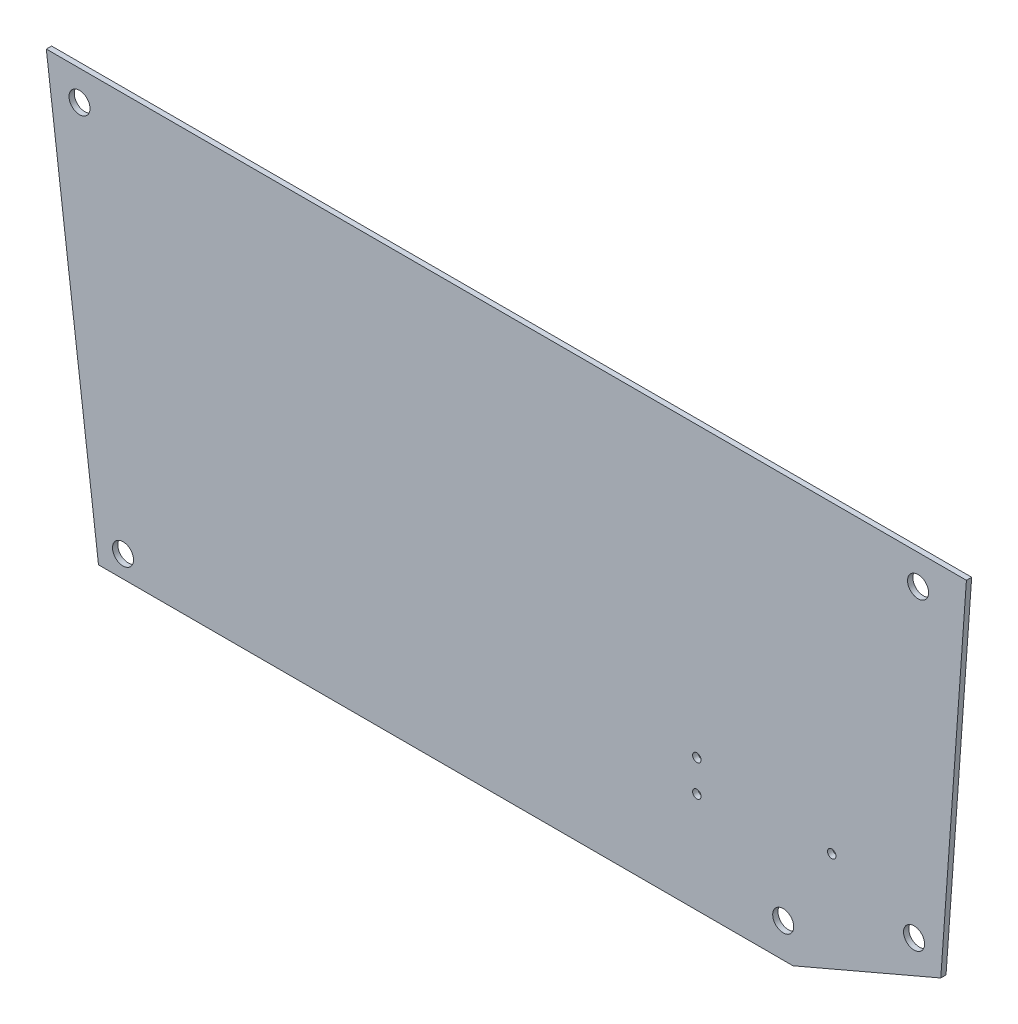
ISO-10303-21;
HEADER;
FILE_DESCRIPTION(('STEP AP214'),'2;1');
FILE_NAME('part.step','',(''),(''),'','','');
FILE_SCHEMA(('AUTOMOTIVE_DESIGN { 1 0 10303 214 1 1 1 1 }'));
ENDSEC;
DATA;
#1=APPLICATION_CONTEXT('core data for automotive mechanical design processes');
#2=APPLICATION_PROTOCOL_DEFINITION('international standard','automotive_design',2000,#1);
#3=PRODUCT_CONTEXT('',#1,'mechanical');
#4=PRODUCT('Part','Part','',(#3));
#5=PRODUCT_RELATED_PRODUCT_CATEGORY('part','',(#4));
#6=PRODUCT_DEFINITION_FORMATION('','',#4);
#7=PRODUCT_DEFINITION_CONTEXT('part definition',#1,'design');
#8=PRODUCT_DEFINITION('design','',#6,#7);
#9=PRODUCT_DEFINITION_SHAPE('','',#8);
#10=(LENGTH_UNIT() NAMED_UNIT(*) SI_UNIT(.MILLI.,.METRE.));
#11=(NAMED_UNIT(*) PLANE_ANGLE_UNIT() SI_UNIT($,.RADIAN.));
#12=(NAMED_UNIT(*) SI_UNIT($,.STERADIAN.) SOLID_ANGLE_UNIT());
#13=UNCERTAINTY_MEASURE_WITH_UNIT(LENGTH_MEASURE(1.E-05),#10,'distance_accuracy_value','');
#14=(GEOMETRIC_REPRESENTATION_CONTEXT(3) GLOBAL_UNCERTAINTY_ASSIGNED_CONTEXT((#13)) GLOBAL_UNIT_ASSIGNED_CONTEXT((#10,
#11,#12)) REPRESENTATION_CONTEXT('',''));
#15=CARTESIAN_POINT('',(0.,0.,0.));
#16=DIRECTION('',(0.,0.,1.));
#17=DIRECTION('',(1.,0.,0.));
#18=AXIS2_PLACEMENT_3D('',#15,#16,#17);
#19=CARTESIAN_POINT('',(0.,0.,1.));
#20=DIRECTION('',(0.,0.,-1.));
#21=DIRECTION('',(-1.,0.,0.));
#22=AXIS2_PLACEMENT_3D('',#19,#20,#21);
#23=PLANE('',#22);
#24=DIRECTION('',(0.919158092192742,0.393888818775804,0.));
#25=VECTOR('',#24,1.);
#26=CARTESIAN_POINT('',(205.719516192543,2.25215401043338,1.));
#27=LINE('',#26,#25);
#28=CARTESIAN_POINT('',(205.719516192543,2.25215401043338,1.));
#29=VERTEX_POINT('',#28);
#30=CARTESIAN_POINT('',(261.946581062157,26.3472605572175,1.));
#31=VERTEX_POINT('',#30);
#32=EDGE_CURVE('E137',#29,#31,#27,.T.);
#33=ORIENTED_EDGE('',*,*,#32,.T.);
#34=DIRECTION('',(0.0716076392014982,0.997432877946174,0.));
#35=VECTOR('',#34,1.);
#36=CARTESIAN_POINT('',(261.946581062157,26.3472605572175,1.));
#37=LINE('',#36,#35);
#38=CARTESIAN_POINT('',(271.703456728974,162.252154010433,1.));
#39=VERTEX_POINT('',#38);
#40=EDGE_CURVE('E95',#31,#39,#37,.T.);
#41=ORIENTED_EDGE('',*,*,#40,.T.);
#42=DIRECTION('',(-1.,0.,0.));
#43=VECTOR('',#42,1.);
#44=CARTESIAN_POINT('',(271.703456728974,162.252154010433,1.));
#45=LINE('',#44,#43);
#46=CARTESIAN_POINT('',(-78.2965432710262,162.252154010433,1.));
#47=VERTEX_POINT('',#46);
#48=EDGE_CURVE('E99',#39,#47,#45,.T.);
#49=ORIENTED_EDGE('',*,*,#48,.T.);
#50=DIRECTION('',(0.123110812303425,-0.99239293019146,0.));
#51=VECTOR('',#50,1.);
#52=CARTESIAN_POINT('',(-78.2965432710262,162.252154010433,1.));
#53=LINE('',#52,#51);
#54=CARTESIAN_POINT('',(-58.4478226994803,2.25215401043338,1.));
#55=VERTEX_POINT('',#54);
#56=EDGE_CURVE('E103',#47,#55,#53,.T.);
#57=ORIENTED_EDGE('',*,*,#56,.T.);
#58=DIRECTION('',(1.,0.,0.));
#59=VECTOR('',#58,1.);
#60=CARTESIAN_POINT('',(-58.4478226994803,2.25215401043338,1.));
#61=LINE('',#60,#59);
#62=EDGE_CURVE('E61',#55,#29,#61,.T.);
#63=ORIENTED_EDGE('',*,*,#62,.T.);
#64=EDGE_LOOP('',(#33,#41,#49,#57,#63));
#65=FACE_BOUND('',#64,.T.);
#66=CARTESIAN_POINT('',(169.158925411249,40.5476003572159,1.));
#67=DIRECTION('',(0.,0.,1.));
#68=DIRECTION('',(1.,0.,0.));
#69=AXIS2_PLACEMENT_3D('',#66,#67,#68);
#70=CIRCLE('',#69,1.59999999999999);
#71=CARTESIAN_POINT('',(170.758925411249,40.5476003572159,1.));
#72=VERTEX_POINT('',#71);
#73=EDGE_CURVE('E128',#72,#72,#70,.T.);
#74=ORIENTED_EDGE('',*,*,#73,.F.);
#75=EDGE_LOOP('',(#74));
#76=FACE_BOUND('',#75,.T.);
#77=CARTESIAN_POINT('',(169.158925411249,52.5476003572159,1.));
#78=DIRECTION('',(0.,0.,1.));
#79=DIRECTION('',(1.,0.,0.));
#80=AXIS2_PLACEMENT_3D('',#77,#78,#79);
#81=CIRCLE('',#80,1.59999999999999);
#82=CARTESIAN_POINT('',(170.758925411249,52.5476003572159,1.));
#83=VERTEX_POINT('',#82);
#84=EDGE_CURVE('E251',#83,#83,#81,.T.);
#85=ORIENTED_EDGE('',*,*,#84,.F.);
#86=EDGE_LOOP('',(#85));
#87=FACE_BOUND('',#86,.T.);
#88=CARTESIAN_POINT('',(220.457146692597,46.5476003572159,1.));
#89=DIRECTION('',(0.,0.,1.));
#90=DIRECTION('',(1.,0.,0.));
#91=AXIS2_PLACEMENT_3D('',#88,#89,#90);
#92=CIRCLE('',#91,1.59999999999996);
#93=CARTESIAN_POINT('',(222.057146692596,46.5476003572159,1.));
#94=VERTEX_POINT('',#93);
#95=EDGE_CURVE('E243',#94,#94,#92,.T.);
#96=ORIENTED_EDGE('',*,*,#95,.F.);
#97=EDGE_LOOP('',(#96));
#98=FACE_BOUND('',#97,.T.);
#99=CARTESIAN_POINT('',(-65.6743739420307,150.944327279671,1.));
#100=DIRECTION('',(0.,0.,1.));
#101=DIRECTION('',(1.,0.,0.));
#102=AXIS2_PLACEMENT_3D('',#99,#100,#101);
#103=CIRCLE('',#102,4.00000000000001);
#104=CARTESIAN_POINT('',(-61.6743739420307,150.944327279671,1.));
#105=VERTEX_POINT('',#104);
#106=EDGE_CURVE('E235',#105,#105,#103,.T.);
#107=ORIENTED_EDGE('',*,*,#106,.F.);
#108=EDGE_LOOP('',(#107));
#109=FACE_BOUND('',#108,.T.);
#110=CARTESIAN_POINT('',(253.311068017116,150.944327279671,1.));
#111=DIRECTION('',(0.,0.,1.));
#112=DIRECTION('',(1.,0.,0.));
#113=AXIS2_PLACEMENT_3D('',#110,#111,#112);
#114=CIRCLE('',#113,3.99999999999999);
#115=CARTESIAN_POINT('',(257.311068017116,150.944327279671,1.));
#116=VERTEX_POINT('',#115);
#117=EDGE_CURVE('E227',#116,#116,#114,.T.);
#118=ORIENTED_EDGE('',*,*,#117,.F.);
#119=EDGE_LOOP('',(#118));
#120=FACE_BOUND('',#119,.T.);
#121=CARTESIAN_POINT('',(202.012846735769,15.2521540104334,1.));
#122=DIRECTION('',(0.,0.,1.));
#123=DIRECTION('',(1.,0.,0.));
#124=AXIS2_PLACEMENT_3D('',#121,#122,#123);
#125=CIRCLE('',#124,3.99999999999999);
#126=CARTESIAN_POINT('',(206.012846735769,15.2521540104334,1.));
#127=VERTEX_POINT('',#126);
#128=EDGE_CURVE('E219',#127,#127,#125,.T.);
#129=ORIENTED_EDGE('',*,*,#128,.F.);
#130=EDGE_LOOP('',(#129));
#131=FACE_BOUND('',#130,.T.);
#132=CARTESIAN_POINT('',(251.787322424635,34.4583310128315,1.));
#133=DIRECTION('',(0.,0.,1.));
#134=DIRECTION('',(1.,0.,0.));
#135=AXIS2_PLACEMENT_3D('',#132,#133,#134);
#136=CIRCLE('',#135,3.99999999999999);
#137=CARTESIAN_POINT('',(255.787322424635,34.4583310128315,1.));
#138=VERTEX_POINT('',#137);
#139=EDGE_CURVE('E211',#138,#138,#136,.T.);
#140=ORIENTED_EDGE('',*,*,#139,.F.);
#141=EDGE_LOOP('',(#140));
#142=FACE_BOUND('',#141,.T.);
#143=CARTESIAN_POINT('',(-49.1265167924749,10.5450439818577,1.));
#144=DIRECTION('',(0.,0.,1.));
#145=DIRECTION('',(1.,0.,0.));
#146=AXIS2_PLACEMENT_3D('',#143,#144,#145);
#147=CIRCLE('',#146,4.00000000000001);
#148=CARTESIAN_POINT('',(-45.1265167924749,10.5450439818577,1.));
#149=VERTEX_POINT('',#148);
#150=EDGE_CURVE('E200',#149,#149,#147,.T.);
#151=ORIENTED_EDGE('',*,*,#150,.F.);
#152=EDGE_LOOP('',(#151));
#153=FACE_BOUND('',#152,.T.);
#154=ADVANCED_FACE('F43',(#65,#76,#87,#98,#109,#120,#131,#142,#153),#23,.F.);
#155=CARTESIAN_POINT('',(0.,0.,-1.));
#156=DIRECTION('',(0.,0.,-1.));
#157=DIRECTION('',(-1.,0.,0.));
#158=AXIS2_PLACEMENT_3D('',#155,#156,#157);
#159=PLANE('',#158);
#160=CARTESIAN_POINT('',(251.787322424635,34.4583310128315,-1.));
#161=DIRECTION('',(0.,0.,1.));
#162=DIRECTION('',(1.,0.,0.));
#163=AXIS2_PLACEMENT_3D('',#160,#161,#162);
#164=CIRCLE('',#163,3.99999999999999);
#165=CARTESIAN_POINT('',(255.787322424635,34.4583310128315,-1.));
#166=VERTEX_POINT('',#165);
#167=EDGE_CURVE('E208',#166,#166,#164,.T.);
#168=ORIENTED_EDGE('',*,*,#167,.T.);
#169=EDGE_LOOP('',(#168));
#170=FACE_BOUND('',#169,.T.);
#171=CARTESIAN_POINT('',(253.311068017116,150.944327279671,-1.));
#172=DIRECTION('',(0.,0.,1.));
#173=DIRECTION('',(1.,0.,0.));
#174=AXIS2_PLACEMENT_3D('',#171,#172,#173);
#175=CIRCLE('',#174,3.99999999999999);
#176=CARTESIAN_POINT('',(257.311068017116,150.944327279671,-1.));
#177=VERTEX_POINT('',#176);
#178=EDGE_CURVE('E223',#177,#177,#175,.T.);
#179=ORIENTED_EDGE('',*,*,#178,.T.);
#180=EDGE_LOOP('',(#179));
#181=FACE_BOUND('',#180,.T.);
#182=CARTESIAN_POINT('',(220.457146692597,46.5476003572159,-1.));
#183=DIRECTION('',(0.,0.,1.));
#184=DIRECTION('',(1.,0.,0.));
#185=AXIS2_PLACEMENT_3D('',#182,#183,#184);
#186=CIRCLE('',#185,1.59999999999996);
#187=CARTESIAN_POINT('',(222.057146692596,46.5476003572159,-1.));
#188=VERTEX_POINT('',#187);
#189=EDGE_CURVE('E239',#188,#188,#186,.T.);
#190=ORIENTED_EDGE('',*,*,#189,.T.);
#191=EDGE_LOOP('',(#190));
#192=FACE_BOUND('',#191,.T.);
#193=CARTESIAN_POINT('',(169.158925411249,40.5476003572159,-1.));
#194=DIRECTION('',(0.,0.,1.));
#195=DIRECTION('',(1.,0.,0.));
#196=AXIS2_PLACEMENT_3D('',#193,#194,#195);
#197=CIRCLE('',#196,1.59999999999999);
#198=CARTESIAN_POINT('',(170.758925411249,40.5476003572159,-1.));
#199=VERTEX_POINT('',#198);
#200=EDGE_CURVE('E255',#199,#199,#197,.T.);
#201=ORIENTED_EDGE('',*,*,#200,.T.);
#202=EDGE_LOOP('',(#201));
#203=FACE_BOUND('',#202,.T.);
#204=DIRECTION('',(0.919158092192742,0.393888818775804,0.));
#205=VECTOR('',#204,1.);
#206=CARTESIAN_POINT('',(205.719516192543,2.25215401043338,-1.));
#207=LINE('',#206,#205);
#208=CARTESIAN_POINT('',(205.719516192543,2.25215401043338,-1.));
#209=VERTEX_POINT('',#208);
#210=CARTESIAN_POINT('',(261.946581062157,26.3472605572175,-1.));
#211=VERTEX_POINT('',#210);
#212=EDGE_CURVE('E123',#209,#211,#207,.T.);
#213=ORIENTED_EDGE('',*,*,#212,.F.);
#214=DIRECTION('',(1.,0.,0.));
#215=VECTOR('',#214,1.);
#216=CARTESIAN_POINT('',(-58.4478226994803,2.25215401043338,-1.));
#217=LINE('',#216,#215);
#218=CARTESIAN_POINT('',(-58.4478226994803,2.25215401043338,-1.));
#219=VERTEX_POINT('',#218);
#220=EDGE_CURVE('E87',#219,#209,#217,.T.);
#221=ORIENTED_EDGE('',*,*,#220,.F.);
#222=DIRECTION('',(0.123110812303425,-0.99239293019146,0.));
#223=VECTOR('',#222,1.);
#224=CARTESIAN_POINT('',(-78.2965432710262,162.252154010433,-1.));
#225=LINE('',#224,#223);
#226=CARTESIAN_POINT('',(-78.2965432710262,162.252154010433,-1.));
#227=VERTEX_POINT('',#226);
#228=EDGE_CURVE('E81',#227,#219,#225,.T.);
#229=ORIENTED_EDGE('',*,*,#228,.F.);
#230=DIRECTION('',(-1.,0.,0.));
#231=VECTOR('',#230,1.);
#232=CARTESIAN_POINT('',(271.703456728974,162.252154010433,-1.));
#233=LINE('',#232,#231);
#234=CARTESIAN_POINT('',(271.703456728974,162.252154010433,-1.));
#235=VERTEX_POINT('',#234);
#236=EDGE_CURVE('E111',#235,#227,#233,.T.);
#237=ORIENTED_EDGE('',*,*,#236,.F.);
#238=DIRECTION('',(0.0716076392014982,0.997432877946174,0.));
#239=VECTOR('',#238,1.);
#240=CARTESIAN_POINT('',(261.946581062157,26.3472605572175,-1.));
#241=LINE('',#240,#239);
#242=EDGE_CURVE('E127',#211,#235,#241,.T.);
#243=ORIENTED_EDGE('',*,*,#242,.F.);
#244=EDGE_LOOP('',(#213,#221,#229,#237,#243));
#245=FACE_BOUND('',#244,.T.);
#246=CARTESIAN_POINT('',(169.158925411249,52.5476003572159,-1.));
#247=DIRECTION('',(0.,0.,1.));
#248=DIRECTION('',(1.,0.,0.));
#249=AXIS2_PLACEMENT_3D('',#246,#247,#248);
#250=CIRCLE('',#249,1.59999999999999);
#251=CARTESIAN_POINT('',(170.758925411249,52.5476003572159,-1.));
#252=VERTEX_POINT('',#251);
#253=EDGE_CURVE('E247',#252,#252,#250,.T.);
#254=ORIENTED_EDGE('',*,*,#253,.T.);
#255=EDGE_LOOP('',(#254));
#256=FACE_BOUND('',#255,.T.);
#257=CARTESIAN_POINT('',(-65.6743739420307,150.944327279671,-1.));
#258=DIRECTION('',(0.,0.,1.));
#259=DIRECTION('',(1.,0.,0.));
#260=AXIS2_PLACEMENT_3D('',#257,#258,#259);
#261=CIRCLE('',#260,4.00000000000001);
#262=CARTESIAN_POINT('',(-61.6743739420307,150.944327279671,-1.));
#263=VERTEX_POINT('',#262);
#264=EDGE_CURVE('E231',#263,#263,#261,.T.);
#265=ORIENTED_EDGE('',*,*,#264,.T.);
#266=EDGE_LOOP('',(#265));
#267=FACE_BOUND('',#266,.T.);
#268=CARTESIAN_POINT('',(202.012846735769,15.2521540104334,-1.));
#269=DIRECTION('',(0.,0.,1.));
#270=DIRECTION('',(1.,0.,0.));
#271=AXIS2_PLACEMENT_3D('',#268,#269,#270);
#272=CIRCLE('',#271,3.99999999999999);
#273=CARTESIAN_POINT('',(206.012846735769,15.2521540104334,-1.));
#274=VERTEX_POINT('',#273);
#275=EDGE_CURVE('E215',#274,#274,#272,.T.);
#276=ORIENTED_EDGE('',*,*,#275,.T.);
#277=EDGE_LOOP('',(#276));
#278=FACE_BOUND('',#277,.T.);
#279=CARTESIAN_POINT('',(-49.1265167924749,10.5450439818577,-1.));
#280=DIRECTION('',(0.,0.,1.));
#281=DIRECTION('',(1.,0.,0.));
#282=AXIS2_PLACEMENT_3D('',#279,#280,#281);
#283=CIRCLE('',#282,4.00000000000001);
#284=CARTESIAN_POINT('',(-45.1265167924749,10.5450439818577,-1.));
#285=VERTEX_POINT('',#284);
#286=EDGE_CURVE('E203',#285,#285,#283,.T.);
#287=ORIENTED_EDGE('',*,*,#286,.T.);
#288=EDGE_LOOP('',(#287));
#289=FACE_BOUND('',#288,.T.);
#290=ADVANCED_FACE('F144',(#170,#181,#192,#203,#245,#256,#267,#278,#289),#159,.T.);
#291=CARTESIAN_POINT('',(205.719516192543,2.25215401043338,1.));
#292=DIRECTION('',(-0.393888818775804,0.919158092192742,0.));
#293=DIRECTION('',(-0.919158092192742,-0.393888818775804,0.));
#294=AXIS2_PLACEMENT_3D('',#291,#292,#293);
#295=PLANE('',#294);
#296=ORIENTED_EDGE('',*,*,#212,.T.);
#297=DIRECTION('',(0.,0.,-1.));
#298=VECTOR('',#297,1.);
#299=CARTESIAN_POINT('',(261.946581062157,26.3472605572175,1.));
#300=LINE('',#299,#298);
#301=EDGE_CURVE('E11',#31,#211,#300,.T.);
#302=ORIENTED_EDGE('',*,*,#301,.F.);
#303=ORIENTED_EDGE('',*,*,#32,.F.);
#304=DIRECTION('',(0.,0.,-1.));
#305=VECTOR('',#304,1.);
#306=CARTESIAN_POINT('',(205.719516192543,2.25215401043338,1.));
#307=LINE('',#306,#305);
#308=EDGE_CURVE('E119',#29,#209,#307,.T.);
#309=ORIENTED_EDGE('',*,*,#308,.T.);
#310=EDGE_LOOP('',(#296,#302,#303,#309));
#311=FACE_BOUND('',#310,.T.);
#312=ADVANCED_FACE('F45',(#311),#295,.F.);
#313=CARTESIAN_POINT('',(261.946581062157,26.3472605572175,1.));
#314=DIRECTION('',(-0.997432877946174,0.0716076392014982,0.));
#315=DIRECTION('',(-0.0716076392014982,-0.997432877946174,0.));
#316=AXIS2_PLACEMENT_3D('',#313,#314,#315);
#317=PLANE('',#316);
#318=ORIENTED_EDGE('',*,*,#242,.T.);
#319=DIRECTION('',(0.,0.,-1.));
#320=VECTOR('',#319,1.);
#321=CARTESIAN_POINT('',(271.703456728974,162.252154010433,1.));
#322=LINE('',#321,#320);
#323=EDGE_CURVE('E53',#39,#235,#322,.T.);
#324=ORIENTED_EDGE('',*,*,#323,.F.);
#325=ORIENTED_EDGE('',*,*,#40,.F.);
#326=ORIENTED_EDGE('',*,*,#301,.T.);
#327=EDGE_LOOP('',(#318,#324,#325,#326));
#328=FACE_BOUND('',#327,.T.);
#329=ADVANCED_FACE('F350',(#328),#317,.F.);
#330=CARTESIAN_POINT('',(271.703456728974,162.252154010433,1.));
#331=DIRECTION('',(0.,-1.,0.));
#332=DIRECTION('',(1.,0.,0.));
#333=AXIS2_PLACEMENT_3D('',#330,#331,#332);
#334=PLANE('',#333);
#335=ORIENTED_EDGE('',*,*,#236,.T.);
#336=DIRECTION('',(0.,0.,-1.));
#337=VECTOR('',#336,1.);
#338=CARTESIAN_POINT('',(-78.2965432710262,162.252154010433,1.));
#339=LINE('',#338,#337);
#340=EDGE_CURVE('E108',#47,#227,#339,.T.);
#341=ORIENTED_EDGE('',*,*,#340,.F.);
#342=ORIENTED_EDGE('',*,*,#48,.F.);
#343=ORIENTED_EDGE('',*,*,#323,.T.);
#344=EDGE_LOOP('',(#335,#341,#342,#343));
#345=FACE_BOUND('',#344,.T.);
#346=ADVANCED_FACE('F109',(#345),#334,.F.);
#347=CARTESIAN_POINT('',(-78.2965432710262,162.252154010433,1.));
#348=DIRECTION('',(0.992392930191459,0.123110812303425,0.));
#349=DIRECTION('',(-0.123110812303425,0.99239293019146,0.));
#350=AXIS2_PLACEMENT_3D('',#347,#348,#349);
#351=PLANE('',#350);
#352=ORIENTED_EDGE('',*,*,#228,.T.);
#353=DIRECTION('',(0.,0.,-1.));
#354=VECTOR('',#353,1.);
#355=CARTESIAN_POINT('',(-58.4478226994803,2.25215401043338,1.));
#356=LINE('',#355,#354);
#357=EDGE_CURVE('E113',#55,#219,#356,.T.);
#358=ORIENTED_EDGE('',*,*,#357,.F.);
#359=ORIENTED_EDGE('',*,*,#56,.F.);
#360=ORIENTED_EDGE('',*,*,#340,.T.);
#361=EDGE_LOOP('',(#352,#358,#359,#360));
#362=FACE_BOUND('',#361,.T.);
#363=ADVANCED_FACE('F115',(#362),#351,.F.);
#364=CARTESIAN_POINT('',(-58.4478226994803,2.25215401043338,1.));
#365=DIRECTION('',(0.,1.,0.));
#366=DIRECTION('',(-1.,0.,0.));
#367=AXIS2_PLACEMENT_3D('',#364,#365,#366);
#368=PLANE('',#367);
#369=ORIENTED_EDGE('',*,*,#220,.T.);
#370=ORIENTED_EDGE('',*,*,#308,.F.);
#371=ORIENTED_EDGE('',*,*,#62,.F.);
#372=ORIENTED_EDGE('',*,*,#357,.T.);
#373=EDGE_LOOP('',(#369,#370,#371,#372));
#374=FACE_BOUND('',#373,.T.);
#375=ADVANCED_FACE('F149',(#374),#368,.F.);
#376=CARTESIAN_POINT('',(169.158925411249,40.5476003572159,1.));
#377=DIRECTION('',(0.,0.,-1.));
#378=DIRECTION('',(-1.,0.,0.));
#379=AXIS2_PLACEMENT_3D('',#376,#377,#378);
#380=CYLINDRICAL_SURFACE('',#379,1.59999999999999);
#381=ORIENTED_EDGE('',*,*,#73,.T.);
#382=EDGE_LOOP('',(#381));
#383=FACE_BOUND('',#382,.T.);
#384=ORIENTED_EDGE('',*,*,#200,.F.);
#385=EDGE_LOOP('',(#384));
#386=FACE_BOUND('',#385,.T.);
#387=ADVANCED_FACE('F151',(#383,#386),#380,.F.);
#388=CARTESIAN_POINT('',(169.158925411249,52.5476003572159,1.));
#389=DIRECTION('',(0.,0.,-1.));
#390=DIRECTION('',(-1.,0.,0.));
#391=AXIS2_PLACEMENT_3D('',#388,#389,#390);
#392=CYLINDRICAL_SURFACE('',#391,1.59999999999999);
#393=ORIENTED_EDGE('',*,*,#84,.T.);
#394=EDGE_LOOP('',(#393));
#395=FACE_BOUND('',#394,.T.);
#396=ORIENTED_EDGE('',*,*,#253,.F.);
#397=EDGE_LOOP('',(#396));
#398=FACE_BOUND('',#397,.T.);
#399=ADVANCED_FACE('F157',(#395,#398),#392,.F.);
#400=CARTESIAN_POINT('',(220.457146692597,46.5476003572159,1.));
#401=DIRECTION('',(0.,0.,-1.));
#402=DIRECTION('',(-1.,0.,0.));
#403=AXIS2_PLACEMENT_3D('',#400,#401,#402);
#404=CYLINDRICAL_SURFACE('',#403,1.59999999999996);
#405=ORIENTED_EDGE('',*,*,#95,.T.);
#406=EDGE_LOOP('',(#405));
#407=FACE_BOUND('',#406,.T.);
#408=ORIENTED_EDGE('',*,*,#189,.F.);
#409=EDGE_LOOP('',(#408));
#410=FACE_BOUND('',#409,.T.);
#411=ADVANCED_FACE('F171',(#407,#410),#404,.F.);
#412=CARTESIAN_POINT('',(-65.6743739420307,150.944327279671,1.));
#413=DIRECTION('',(0.,0.,-1.));
#414=DIRECTION('',(-1.,0.,0.));
#415=AXIS2_PLACEMENT_3D('',#412,#413,#414);
#416=CYLINDRICAL_SURFACE('',#415,4.00000000000001);
#417=ORIENTED_EDGE('',*,*,#106,.T.);
#418=EDGE_LOOP('',(#417));
#419=FACE_BOUND('',#418,.T.);
#420=ORIENTED_EDGE('',*,*,#264,.F.);
#421=EDGE_LOOP('',(#420));
#422=FACE_BOUND('',#421,.T.);
#423=ADVANCED_FACE('F175',(#419,#422),#416,.F.);
#424=CARTESIAN_POINT('',(253.311068017116,150.944327279671,1.));
#425=DIRECTION('',(0.,0.,-1.));
#426=DIRECTION('',(-1.,0.,0.));
#427=AXIS2_PLACEMENT_3D('',#424,#425,#426);
#428=CYLINDRICAL_SURFACE('',#427,3.99999999999999);
#429=ORIENTED_EDGE('',*,*,#117,.T.);
#430=EDGE_LOOP('',(#429));
#431=FACE_BOUND('',#430,.T.);
#432=ORIENTED_EDGE('',*,*,#178,.F.);
#433=EDGE_LOOP('',(#432));
#434=FACE_BOUND('',#433,.T.);
#435=ADVANCED_FACE('F179',(#431,#434),#428,.F.);
#436=CARTESIAN_POINT('',(202.012846735769,15.2521540104334,1.));
#437=DIRECTION('',(0.,0.,-1.));
#438=DIRECTION('',(-1.,0.,0.));
#439=AXIS2_PLACEMENT_3D('',#436,#437,#438);
#440=CYLINDRICAL_SURFACE('',#439,3.99999999999999);
#441=ORIENTED_EDGE('',*,*,#128,.T.);
#442=EDGE_LOOP('',(#441));
#443=FACE_BOUND('',#442,.T.);
#444=ORIENTED_EDGE('',*,*,#275,.F.);
#445=EDGE_LOOP('',(#444));
#446=FACE_BOUND('',#445,.T.);
#447=ADVANCED_FACE('F183',(#443,#446),#440,.F.);
#448=CARTESIAN_POINT('',(251.787322424635,34.4583310128315,1.));
#449=DIRECTION('',(0.,0.,-1.));
#450=DIRECTION('',(-1.,0.,0.));
#451=AXIS2_PLACEMENT_3D('',#448,#449,#450);
#452=CYLINDRICAL_SURFACE('',#451,3.99999999999999);
#453=ORIENTED_EDGE('',*,*,#139,.T.);
#454=EDGE_LOOP('',(#453));
#455=FACE_BOUND('',#454,.T.);
#456=ORIENTED_EDGE('',*,*,#167,.F.);
#457=EDGE_LOOP('',(#456));
#458=FACE_BOUND('',#457,.T.);
#459=ADVANCED_FACE('F187',(#455,#458),#452,.F.);
#460=CARTESIAN_POINT('',(-49.1265167924749,10.5450439818577,1.));
#461=DIRECTION('',(0.,0.,-1.));
#462=DIRECTION('',(-1.,0.,0.));
#463=AXIS2_PLACEMENT_3D('',#460,#461,#462);
#464=CYLINDRICAL_SURFACE('',#463,4.00000000000001);
#465=ORIENTED_EDGE('',*,*,#150,.T.);
#466=EDGE_LOOP('',(#465));
#467=FACE_BOUND('',#466,.T.);
#468=ORIENTED_EDGE('',*,*,#286,.F.);
#469=EDGE_LOOP('',(#468));
#470=FACE_BOUND('',#469,.T.);
#471=ADVANCED_FACE('F191',(#467,#470),#464,.F.);
#472=CLOSED_SHELL('',(#154,#290,#312,#329,#346,#363,#375,#387,#399,#411,#423,#435,#447,#459,#471));
#473=MANIFOLD_SOLID_BREP('B2',#472);
#474=ADVANCED_BREP_SHAPE_REPRESENTATION('',(#18,#473),#14);
#475=SHAPE_DEFINITION_REPRESENTATION(#9,#474);
ENDSEC;
END-ISO-10303-21;
